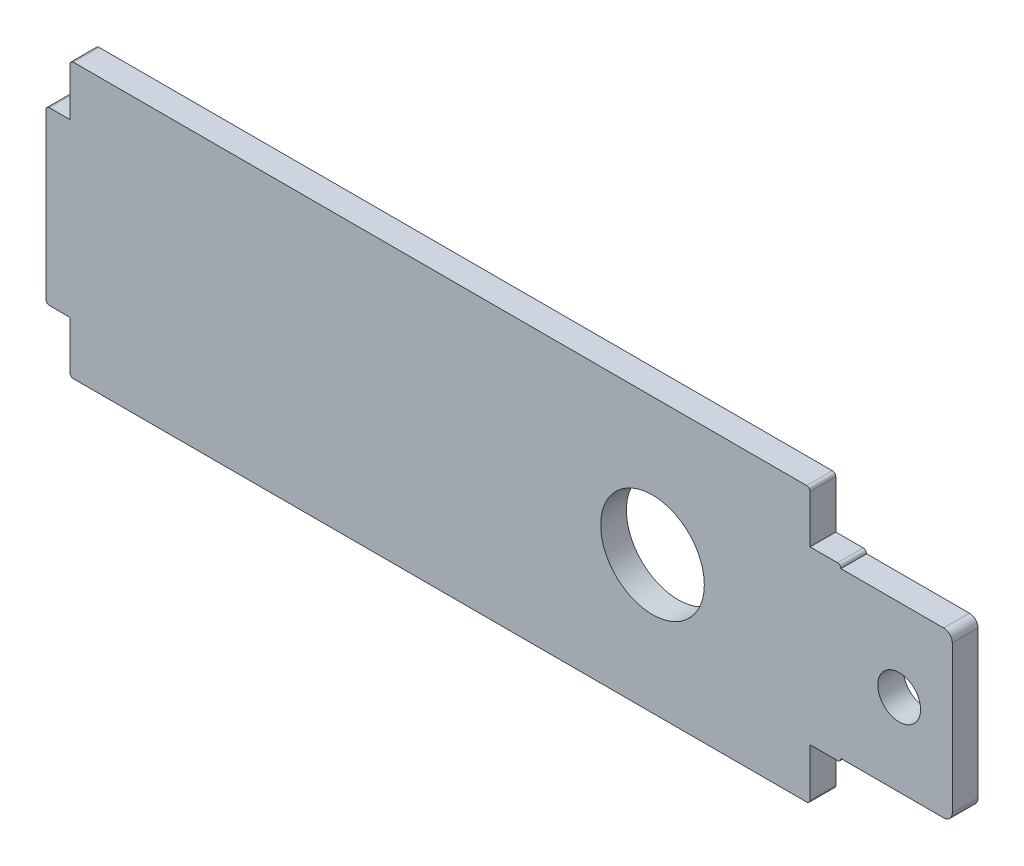
ISO-10303-21;
HEADER;
FILE_DESCRIPTION(('STEP AP214'),'2;1');
FILE_NAME('part.step','',(''),(''),'','','');
FILE_SCHEMA(('AUTOMOTIVE_DESIGN { 1 0 10303 214 1 1 1 1 }'));
ENDSEC;
DATA;
#1=APPLICATION_CONTEXT('core data for automotive mechanical design processes');
#2=APPLICATION_PROTOCOL_DEFINITION('international standard','automotive_design',2000,#1);
#3=PRODUCT_CONTEXT('',#1,'mechanical');
#4=PRODUCT('Part','Part','',(#3));
#5=PRODUCT_RELATED_PRODUCT_CATEGORY('part','',(#4));
#6=PRODUCT_DEFINITION_FORMATION('','',#4);
#7=PRODUCT_DEFINITION_CONTEXT('part definition',#1,'design');
#8=PRODUCT_DEFINITION('design','',#6,#7);
#9=PRODUCT_DEFINITION_SHAPE('','',#8);
#10=(LENGTH_UNIT() NAMED_UNIT(*) SI_UNIT(.MILLI.,.METRE.));
#11=(NAMED_UNIT(*) PLANE_ANGLE_UNIT() SI_UNIT($,.RADIAN.));
#12=(NAMED_UNIT(*) SI_UNIT($,.STERADIAN.) SOLID_ANGLE_UNIT());
#13=UNCERTAINTY_MEASURE_WITH_UNIT(LENGTH_MEASURE(1.E-05),#10,'distance_accuracy_value','');
#14=(GEOMETRIC_REPRESENTATION_CONTEXT(3) GLOBAL_UNCERTAINTY_ASSIGNED_CONTEXT((#13)) GLOBAL_UNIT_ASSIGNED_CONTEXT((#10,
#11,#12)) REPRESENTATION_CONTEXT('',''));
#15=CARTESIAN_POINT('',(0.,0.,0.));
#16=DIRECTION('',(0.,0.,1.));
#17=DIRECTION('',(1.,0.,0.));
#18=AXIS2_PLACEMENT_3D('',#15,#16,#17);
#19=CARTESIAN_POINT('',(44.4,2.2,-1.5));
#20=DIRECTION('',(0.,0.,1.));
#21=DIRECTION('',(1.,0.,0.));
#22=AXIS2_PLACEMENT_3D('',#19,#20,#21);
#23=CYLINDRICAL_SURFACE('',#22,0.200000000000003);
#24=CARTESIAN_POINT('',(44.4,2.2,0.));
#25=DIRECTION('',(0.,0.,1.));
#26=DIRECTION('',(-1.,0.,0.));
#27=AXIS2_PLACEMENT_3D('',#24,#25,#26);
#28=CIRCLE('',#27,0.200000000000003);
#29=CARTESIAN_POINT('',(44.4,2.,0.));
#30=VERTEX_POINT('',#29);
#31=CARTESIAN_POINT('',(44.6,2.2,0.));
#32=VERTEX_POINT('',#31);
#33=EDGE_CURVE('E204',#30,#32,#28,.T.);
#34=ORIENTED_EDGE('',*,*,#33,.F.);
#35=DIRECTION('',(0.,0.,1.));
#36=VECTOR('',#35,1.);
#37=CARTESIAN_POINT('',(44.4,2.,-1.5));
#38=LINE('',#37,#36);
#39=CARTESIAN_POINT('',(44.4,2.,-1.5));
#40=VERTEX_POINT('',#39);
#41=EDGE_CURVE('E11',#40,#30,#38,.T.);
#42=ORIENTED_EDGE('',*,*,#41,.F.);
#43=CARTESIAN_POINT('',(44.4,2.2,-1.5));
#44=DIRECTION('',(0.,0.,1.));
#45=DIRECTION('',(-1.,0.,0.));
#46=AXIS2_PLACEMENT_3D('',#43,#44,#45);
#47=CIRCLE('',#46,0.200000000000003);
#48=CARTESIAN_POINT('',(44.6,2.2,-1.5));
#49=VERTEX_POINT('',#48);
#50=EDGE_CURVE('E258',#40,#49,#47,.T.);
#51=ORIENTED_EDGE('',*,*,#50,.T.);
#52=DIRECTION('',(0.,0.,1.));
#53=VECTOR('',#52,1.);
#54=CARTESIAN_POINT('',(44.6,2.2,-1.5));
#55=LINE('',#54,#53);
#56=EDGE_CURVE('E42',#49,#32,#55,.T.);
#57=ORIENTED_EDGE('',*,*,#56,.T.);
#58=EDGE_LOOP('',(#34,#42,#51,#57));
#59=FACE_BOUND('',#58,.T.);
#60=ADVANCED_FACE('F39',(#59),#23,.T.);
#61=CARTESIAN_POINT('',(1.6,2.,-1.5));
#62=DIRECTION('',(0.,-1.,0.));
#63=DIRECTION('',(1.,0.,0.));
#64=AXIS2_PLACEMENT_3D('',#61,#62,#63);
#65=PLANE('',#64);
#66=DIRECTION('',(1.,0.,0.));
#67=VECTOR('',#66,1.);
#68=CARTESIAN_POINT('',(1.6,2.,0.));
#69=LINE('',#68,#67);
#70=CARTESIAN_POINT('',(1.6,2.,0.));
#71=VERTEX_POINT('',#70);
#72=EDGE_CURVE('E256',#71,#30,#69,.T.);
#73=ORIENTED_EDGE('',*,*,#72,.F.);
#74=DIRECTION('',(0.,0.,1.));
#75=VECTOR('',#74,1.);
#76=CARTESIAN_POINT('',(1.6,2.,-1.5));
#77=LINE('',#76,#75);
#78=CARTESIAN_POINT('',(1.6,2.,-1.5));
#79=VERTEX_POINT('',#78);
#80=EDGE_CURVE('E48',#79,#71,#77,.T.);
#81=ORIENTED_EDGE('',*,*,#80,.F.);
#82=DIRECTION('',(1.,0.,0.));
#83=VECTOR('',#82,1.);
#84=CARTESIAN_POINT('',(1.6,2.,-1.5));
#85=LINE('',#84,#83);
#86=EDGE_CURVE('E194',#79,#40,#85,.T.);
#87=ORIENTED_EDGE('',*,*,#86,.T.);
#88=ORIENTED_EDGE('',*,*,#41,.T.);
#89=EDGE_LOOP('',(#73,#81,#87,#88));
#90=FACE_BOUND('',#89,.T.);
#91=ADVANCED_FACE('F297',(#90),#65,.T.);
#92=CARTESIAN_POINT('',(1.6,2.2,-1.5));
#93=DIRECTION('',(0.,0.,1.));
#94=DIRECTION('',(1.,0.,0.));
#95=AXIS2_PLACEMENT_3D('',#92,#93,#94);
#96=CYLINDRICAL_SURFACE('',#95,0.2);
#97=CARTESIAN_POINT('',(1.6,2.2,0.));
#98=DIRECTION('',(0.,0.,1.));
#99=DIRECTION('',(1.,0.,0.));
#100=AXIS2_PLACEMENT_3D('',#97,#98,#99);
#101=CIRCLE('',#100,0.2);
#102=CARTESIAN_POINT('',(1.4,2.2,0.));
#103=VERTEX_POINT('',#102);
#104=EDGE_CURVE('E180',#103,#71,#101,.T.);
#105=ORIENTED_EDGE('',*,*,#104,.F.);
#106=DIRECTION('',(0.,0.,1.));
#107=VECTOR('',#106,1.);
#108=CARTESIAN_POINT('',(1.4,2.2,-1.5));
#109=LINE('',#108,#107);
#110=CARTESIAN_POINT('',(1.4,2.2,-1.5));
#111=VERTEX_POINT('',#110);
#112=EDGE_CURVE('E175',#111,#103,#109,.T.);
#113=ORIENTED_EDGE('',*,*,#112,.F.);
#114=CARTESIAN_POINT('',(1.6,2.2,-1.5));
#115=DIRECTION('',(0.,0.,1.));
#116=DIRECTION('',(1.,0.,0.));
#117=AXIS2_PLACEMENT_3D('',#114,#115,#116);
#118=CIRCLE('',#117,0.2);
#119=EDGE_CURVE('E178',#111,#79,#118,.T.);
#120=ORIENTED_EDGE('',*,*,#119,.T.);
#121=ORIENTED_EDGE('',*,*,#80,.T.);
#122=EDGE_LOOP('',(#105,#113,#120,#121));
#123=FACE_BOUND('',#122,.T.);
#124=ADVANCED_FACE('F177',(#123),#96,.T.);
#125=CARTESIAN_POINT('',(1.4,2.2,-1.5));
#126=DIRECTION('',(-1.,0.,0.));
#127=DIRECTION('',(0.,-1.,0.));
#128=AXIS2_PLACEMENT_3D('',#125,#126,#127);
#129=PLANE('',#128);
#130=DIRECTION('',(0.,-1.,0.));
#131=VECTOR('',#130,1.);
#132=CARTESIAN_POINT('',(1.4,2.2,0.));
#133=LINE('',#132,#131);
#134=CARTESIAN_POINT('',(1.4,5.,0.));
#135=VERTEX_POINT('',#134);
#136=EDGE_CURVE('E253',#135,#103,#133,.T.);
#137=ORIENTED_EDGE('',*,*,#136,.F.);
#138=DIRECTION('',(0.,0.,1.));
#139=VECTOR('',#138,1.);
#140=CARTESIAN_POINT('',(1.4,5.,-1.5));
#141=LINE('',#140,#139);
#142=CARTESIAN_POINT('',(1.4,5.,-1.5));
#143=VERTEX_POINT('',#142);
#144=EDGE_CURVE('E185',#143,#135,#141,.T.);
#145=ORIENTED_EDGE('',*,*,#144,.F.);
#146=DIRECTION('',(0.,-1.,0.));
#147=VECTOR('',#146,1.);
#148=CARTESIAN_POINT('',(1.4,2.2,-1.5));
#149=LINE('',#148,#147);
#150=EDGE_CURVE('E192',#143,#111,#149,.T.);
#151=ORIENTED_EDGE('',*,*,#150,.T.);
#152=ORIENTED_EDGE('',*,*,#112,.T.);
#153=EDGE_LOOP('',(#137,#145,#151,#152));
#154=FACE_BOUND('',#153,.T.);
#155=ADVANCED_FACE('F196',(#154),#129,.T.);
#156=CARTESIAN_POINT('',(1.4,5.,-1.5));
#157=DIRECTION('',(0.,-1.,0.));
#158=DIRECTION('',(0.,0.,-1.));
#159=AXIS2_PLACEMENT_3D('',#156,#157,#158);
#160=PLANE('',#159);
#161=DIRECTION('',(1.,0.,0.));
#162=VECTOR('',#161,1.);
#163=CARTESIAN_POINT('',(1.4,5.,0.));
#164=LINE('',#163,#162);
#165=CARTESIAN_POINT('',(0.200000000000002,5.,0.));
#166=VERTEX_POINT('',#165);
#167=EDGE_CURVE('E250',#166,#135,#164,.T.);
#168=ORIENTED_EDGE('',*,*,#167,.F.);
#169=DIRECTION('',(0.,0.,1.));
#170=VECTOR('',#169,1.);
#171=CARTESIAN_POINT('',(0.200000000000002,5.,-1.5));
#172=LINE('',#171,#170);
#173=CARTESIAN_POINT('',(0.200000000000002,5.,-1.5));
#174=VERTEX_POINT('',#173);
#175=EDGE_CURVE('E262',#174,#166,#172,.T.);
#176=ORIENTED_EDGE('',*,*,#175,.F.);
#177=DIRECTION('',(1.,0.,0.));
#178=VECTOR('',#177,1.);
#179=CARTESIAN_POINT('',(1.4,5.,-1.5));
#180=LINE('',#179,#178);
#181=EDGE_CURVE('E197',#174,#143,#180,.T.);
#182=ORIENTED_EDGE('',*,*,#181,.T.);
#183=ORIENTED_EDGE('',*,*,#144,.T.);
#184=EDGE_LOOP('',(#168,#176,#182,#183));
#185=FACE_BOUND('',#184,.T.);
#186=ADVANCED_FACE('F310',(#185),#160,.T.);
#187=CARTESIAN_POINT('',(0.2,5.2,-1.5));
#188=DIRECTION('',(0.,0.,1.));
#189=DIRECTION('',(1.,0.,0.));
#190=AXIS2_PLACEMENT_3D('',#187,#188,#189);
#191=CYLINDRICAL_SURFACE('',#190,0.2);
#192=CARTESIAN_POINT('',(0.2,5.2,0.));
#193=DIRECTION('',(0.,0.,1.));
#194=DIRECTION('',(-1.,0.,0.));
#195=AXIS2_PLACEMENT_3D('',#192,#193,#194);
#196=CIRCLE('',#195,0.2);
#197=CARTESIAN_POINT('',(0.,5.2,0.));
#198=VERTEX_POINT('',#197);
#199=EDGE_CURVE('E247',#198,#166,#196,.T.);
#200=ORIENTED_EDGE('',*,*,#199,.F.);
#201=DIRECTION('',(0.,0.,1.));
#202=VECTOR('',#201,1.);
#203=CARTESIAN_POINT('',(0.,5.2,-1.5));
#204=LINE('',#203,#202);
#205=CARTESIAN_POINT('',(0.,5.2,-1.5));
#206=VERTEX_POINT('',#205);
#207=EDGE_CURVE('E264',#206,#198,#204,.T.);
#208=ORIENTED_EDGE('',*,*,#207,.F.);
#209=CARTESIAN_POINT('',(0.2,5.2,-1.5));
#210=DIRECTION('',(0.,0.,1.));
#211=DIRECTION('',(-1.,0.,0.));
#212=AXIS2_PLACEMENT_3D('',#209,#210,#211);
#213=CIRCLE('',#212,0.2);
#214=EDGE_CURVE('E199',#206,#174,#213,.T.);
#215=ORIENTED_EDGE('',*,*,#214,.T.);
#216=ORIENTED_EDGE('',*,*,#175,.T.);
#217=EDGE_LOOP('',(#200,#208,#215,#216));
#218=FACE_BOUND('',#217,.T.);
#219=ADVANCED_FACE('F313',(#218),#191,.T.);
#220=CARTESIAN_POINT('',(0.,5.2,-1.5));
#221=DIRECTION('',(-1.,0.,0.));
#222=DIRECTION('',(0.,0.,1.));
#223=AXIS2_PLACEMENT_3D('',#220,#221,#222);
#224=PLANE('',#223);
#225=DIRECTION('',(0.,-1.,0.));
#226=VECTOR('',#225,1.);
#227=CARTESIAN_POINT('',(0.,5.2,0.));
#228=LINE('',#227,#226);
#229=CARTESIAN_POINT('',(0.,14.8,0.));
#230=VERTEX_POINT('',#229);
#231=EDGE_CURVE('E244',#230,#198,#228,.T.);
#232=ORIENTED_EDGE('',*,*,#231,.F.);
#233=DIRECTION('',(0.,0.,1.));
#234=VECTOR('',#233,1.);
#235=CARTESIAN_POINT('',(0.,14.8,-1.5));
#236=LINE('',#235,#234);
#237=CARTESIAN_POINT('',(0.,14.8,-1.5));
#238=VERTEX_POINT('',#237);
#239=EDGE_CURVE('E266',#238,#230,#236,.T.);
#240=ORIENTED_EDGE('',*,*,#239,.F.);
#241=DIRECTION('',(0.,-1.,0.));
#242=VECTOR('',#241,1.);
#243=CARTESIAN_POINT('',(0.,5.2,-1.5));
#244=LINE('',#243,#242);
#245=EDGE_CURVE('E496',#238,#206,#244,.T.);
#246=ORIENTED_EDGE('',*,*,#245,.T.);
#247=ORIENTED_EDGE('',*,*,#207,.T.);
#248=EDGE_LOOP('',(#232,#240,#246,#247));
#249=FACE_BOUND('',#248,.T.);
#250=ADVANCED_FACE('F317',(#249),#224,.T.);
#251=CARTESIAN_POINT('',(0.2,14.8,-1.5));
#252=DIRECTION('',(0.,0.,1.));
#253=DIRECTION('',(1.,0.,0.));
#254=AXIS2_PLACEMENT_3D('',#251,#252,#253);
#255=CYLINDRICAL_SURFACE('',#254,0.2);
#256=CARTESIAN_POINT('',(0.2,14.8,0.));
#257=DIRECTION('',(0.,0.,1.));
#258=DIRECTION('',(1.,0.,0.));
#259=AXIS2_PLACEMENT_3D('',#256,#257,#258);
#260=CIRCLE('',#259,0.2);
#261=CARTESIAN_POINT('',(0.200000000000001,15.,0.));
#262=VERTEX_POINT('',#261);
#263=EDGE_CURVE('E241',#262,#230,#260,.T.);
#264=ORIENTED_EDGE('',*,*,#263,.F.);
#265=DIRECTION('',(0.,0.,1.));
#266=VECTOR('',#265,1.);
#267=CARTESIAN_POINT('',(0.200000000000001,15.,-1.5));
#268=LINE('',#267,#266);
#269=CARTESIAN_POINT('',(0.200000000000001,15.,-1.5));
#270=VERTEX_POINT('',#269);
#271=EDGE_CURVE('E268',#270,#262,#268,.T.);
#272=ORIENTED_EDGE('',*,*,#271,.F.);
#273=CARTESIAN_POINT('',(0.2,14.8,-1.5));
#274=DIRECTION('',(0.,0.,1.));
#275=DIRECTION('',(1.,0.,0.));
#276=AXIS2_PLACEMENT_3D('',#273,#274,#275);
#277=CIRCLE('',#276,0.2);
#278=EDGE_CURVE('E493',#270,#238,#277,.T.);
#279=ORIENTED_EDGE('',*,*,#278,.T.);
#280=ORIENTED_EDGE('',*,*,#239,.T.);
#281=EDGE_LOOP('',(#264,#272,#279,#280));
#282=FACE_BOUND('',#281,.T.);
#283=ADVANCED_FACE('F321',(#282),#255,.T.);
#284=CARTESIAN_POINT('',(1.4,15.,-1.5));
#285=DIRECTION('',(0.,1.,0.));
#286=DIRECTION('',(0.,0.,1.));
#287=AXIS2_PLACEMENT_3D('',#284,#285,#286);
#288=PLANE('',#287);
#289=DIRECTION('',(-1.,0.,0.));
#290=VECTOR('',#289,1.);
#291=CARTESIAN_POINT('',(1.4,15.,0.));
#292=LINE('',#291,#290);
#293=CARTESIAN_POINT('',(1.4,15.,0.));
#294=VERTEX_POINT('',#293);
#295=EDGE_CURVE('E238',#294,#262,#292,.T.);
#296=ORIENTED_EDGE('',*,*,#295,.F.);
#297=DIRECTION('',(0.,0.,1.));
#298=VECTOR('',#297,1.);
#299=CARTESIAN_POINT('',(1.4,15.,-1.5));
#300=LINE('',#299,#298);
#301=CARTESIAN_POINT('',(1.4,15.,-1.5));
#302=VERTEX_POINT('',#301);
#303=EDGE_CURVE('E270',#302,#294,#300,.T.);
#304=ORIENTED_EDGE('',*,*,#303,.F.);
#305=DIRECTION('',(-1.,0.,0.));
#306=VECTOR('',#305,1.);
#307=CARTESIAN_POINT('',(1.4,15.,-1.5));
#308=LINE('',#307,#306);
#309=EDGE_CURVE('E490',#302,#270,#308,.T.);
#310=ORIENTED_EDGE('',*,*,#309,.T.);
#311=ORIENTED_EDGE('',*,*,#271,.T.);
#312=EDGE_LOOP('',(#296,#304,#310,#311));
#313=FACE_BOUND('',#312,.T.);
#314=ADVANCED_FACE('F325',(#313),#288,.T.);
#315=CARTESIAN_POINT('',(1.4,17.8,-1.5));
#316=DIRECTION('',(-1.,0.,0.));
#317=DIRECTION('',(0.,-1.,0.));
#318=AXIS2_PLACEMENT_3D('',#315,#316,#317);
#319=PLANE('',#318);
#320=DIRECTION('',(0.,-1.,0.));
#321=VECTOR('',#320,1.);
#322=CARTESIAN_POINT('',(1.4,17.8,0.));
#323=LINE('',#322,#321);
#324=CARTESIAN_POINT('',(1.4,17.8,0.));
#325=VERTEX_POINT('',#324);
#326=EDGE_CURVE('E235',#325,#294,#323,.T.);
#327=ORIENTED_EDGE('',*,*,#326,.F.);
#328=DIRECTION('',(0.,0.,1.));
#329=VECTOR('',#328,1.);
#330=CARTESIAN_POINT('',(1.4,17.8,-1.5));
#331=LINE('',#330,#329);
#332=CARTESIAN_POINT('',(1.4,17.8,-1.5));
#333=VERTEX_POINT('',#332);
#334=EDGE_CURVE('E272',#333,#325,#331,.T.);
#335=ORIENTED_EDGE('',*,*,#334,.F.);
#336=DIRECTION('',(0.,-1.,0.));
#337=VECTOR('',#336,1.);
#338=CARTESIAN_POINT('',(1.4,17.8,-1.5));
#339=LINE('',#338,#337);
#340=EDGE_CURVE('E487',#333,#302,#339,.T.);
#341=ORIENTED_EDGE('',*,*,#340,.T.);
#342=ORIENTED_EDGE('',*,*,#303,.T.);
#343=EDGE_LOOP('',(#327,#335,#341,#342));
#344=FACE_BOUND('',#343,.T.);
#345=ADVANCED_FACE('F329',(#344),#319,.T.);
#346=CARTESIAN_POINT('',(1.6,17.8,-1.5));
#347=DIRECTION('',(0.,0.,1.));
#348=DIRECTION('',(1.,0.,0.));
#349=AXIS2_PLACEMENT_3D('',#346,#347,#348);
#350=CYLINDRICAL_SURFACE('',#349,0.200000000000001);
#351=CARTESIAN_POINT('',(1.6,17.8,0.));
#352=DIRECTION('',(0.,0.,1.));
#353=DIRECTION('',(-1.,0.,0.));
#354=AXIS2_PLACEMENT_3D('',#351,#352,#353);
#355=CIRCLE('',#354,0.200000000000001);
#356=CARTESIAN_POINT('',(1.6,18.,0.));
#357=VERTEX_POINT('',#356);
#358=EDGE_CURVE('E232',#357,#325,#355,.T.);
#359=ORIENTED_EDGE('',*,*,#358,.F.);
#360=DIRECTION('',(0.,0.,1.));
#361=VECTOR('',#360,1.);
#362=CARTESIAN_POINT('',(1.6,18.,-1.5));
#363=LINE('',#362,#361);
#364=CARTESIAN_POINT('',(1.6,18.,-1.5));
#365=VERTEX_POINT('',#364);
#366=EDGE_CURVE('E274',#365,#357,#363,.T.);
#367=ORIENTED_EDGE('',*,*,#366,.F.);
#368=CARTESIAN_POINT('',(1.6,17.8,-1.5));
#369=DIRECTION('',(0.,0.,1.));
#370=DIRECTION('',(-1.,0.,0.));
#371=AXIS2_PLACEMENT_3D('',#368,#369,#370);
#372=CIRCLE('',#371,0.200000000000001);
#373=EDGE_CURVE('E484',#365,#333,#372,.T.);
#374=ORIENTED_EDGE('',*,*,#373,.T.);
#375=ORIENTED_EDGE('',*,*,#334,.T.);
#376=EDGE_LOOP('',(#359,#367,#374,#375));
#377=FACE_BOUND('',#376,.T.);
#378=ADVANCED_FACE('F333',(#377),#350,.T.);
#379=CARTESIAN_POINT('',(1.6,18.,-1.5));
#380=DIRECTION('',(0.,1.,0.));
#381=DIRECTION('',(0.,0.,1.));
#382=AXIS2_PLACEMENT_3D('',#379,#380,#381);
#383=PLANE('',#382);
#384=DIRECTION('',(-1.,0.,0.));
#385=VECTOR('',#384,1.);
#386=CARTESIAN_POINT('',(1.6,18.,0.));
#387=LINE('',#386,#385);
#388=CARTESIAN_POINT('',(44.4,18.,0.));
#389=VERTEX_POINT('',#388);
#390=EDGE_CURVE('E229',#389,#357,#387,.T.);
#391=ORIENTED_EDGE('',*,*,#390,.F.);
#392=DIRECTION('',(0.,0.,1.));
#393=VECTOR('',#392,1.);
#394=CARTESIAN_POINT('',(44.4,18.,-1.5));
#395=LINE('',#394,#393);
#396=CARTESIAN_POINT('',(44.4,18.,-1.5));
#397=VERTEX_POINT('',#396);
#398=EDGE_CURVE('E276',#397,#389,#395,.T.);
#399=ORIENTED_EDGE('',*,*,#398,.F.);
#400=DIRECTION('',(-1.,0.,0.));
#401=VECTOR('',#400,1.);
#402=CARTESIAN_POINT('',(1.6,18.,-1.5));
#403=LINE('',#402,#401);
#404=EDGE_CURVE('E481',#397,#365,#403,.T.);
#405=ORIENTED_EDGE('',*,*,#404,.T.);
#406=ORIENTED_EDGE('',*,*,#366,.T.);
#407=EDGE_LOOP('',(#391,#399,#405,#406));
#408=FACE_BOUND('',#407,.T.);
#409=ADVANCED_FACE('F337',(#408),#383,.T.);
#410=CARTESIAN_POINT('',(44.4,17.8,-1.5));
#411=DIRECTION('',(0.,0.,1.));
#412=DIRECTION('',(1.,0.,0.));
#413=AXIS2_PLACEMENT_3D('',#410,#411,#412);
#414=CYLINDRICAL_SURFACE('',#413,0.200000000000004);
#415=CARTESIAN_POINT('',(44.4,17.8,0.));
#416=DIRECTION('',(0.,0.,1.));
#417=DIRECTION('',(1.,0.,0.));
#418=AXIS2_PLACEMENT_3D('',#415,#416,#417);
#419=CIRCLE('',#418,0.200000000000004);
#420=CARTESIAN_POINT('',(44.6,17.8,0.));
#421=VERTEX_POINT('',#420);
#422=EDGE_CURVE('E226',#421,#389,#419,.T.);
#423=ORIENTED_EDGE('',*,*,#422,.F.);
#424=DIRECTION('',(0.,0.,1.));
#425=VECTOR('',#424,1.);
#426=CARTESIAN_POINT('',(44.6,17.8,-1.5));
#427=LINE('',#426,#425);
#428=CARTESIAN_POINT('',(44.6,17.8,-1.5));
#429=VERTEX_POINT('',#428);
#430=EDGE_CURVE('E278',#429,#421,#427,.T.);
#431=ORIENTED_EDGE('',*,*,#430,.F.);
#432=CARTESIAN_POINT('',(44.4,17.8,-1.5));
#433=DIRECTION('',(0.,0.,1.));
#434=DIRECTION('',(1.,0.,0.));
#435=AXIS2_PLACEMENT_3D('',#432,#433,#434);
#436=CIRCLE('',#435,0.200000000000004);
#437=EDGE_CURVE('E478',#429,#397,#436,.T.);
#438=ORIENTED_EDGE('',*,*,#437,.T.);
#439=ORIENTED_EDGE('',*,*,#398,.T.);
#440=EDGE_LOOP('',(#423,#431,#438,#439));
#441=FACE_BOUND('',#440,.T.);
#442=ADVANCED_FACE('F341',(#441),#414,.T.);
#443=CARTESIAN_POINT('',(44.6,17.8,-1.5));
#444=DIRECTION('',(1.,0.,0.));
#445=DIRECTION('',(0.,0.,-1.));
#446=AXIS2_PLACEMENT_3D('',#443,#444,#445);
#447=PLANE('',#446);
#448=DIRECTION('',(0.,1.,0.));
#449=VECTOR('',#448,1.);
#450=CARTESIAN_POINT('',(44.6,17.8,0.));
#451=LINE('',#450,#449);
#452=CARTESIAN_POINT('',(44.6,15.,0.));
#453=VERTEX_POINT('',#452);
#454=EDGE_CURVE('E223',#453,#421,#451,.T.);
#455=ORIENTED_EDGE('',*,*,#454,.F.);
#456=DIRECTION('',(0.,0.,1.));
#457=VECTOR('',#456,1.);
#458=CARTESIAN_POINT('',(44.6,15.,-1.5));
#459=LINE('',#458,#457);
#460=CARTESIAN_POINT('',(44.6,15.,-1.5));
#461=VERTEX_POINT('',#460);
#462=EDGE_CURVE('E280',#461,#453,#459,.T.);
#463=ORIENTED_EDGE('',*,*,#462,.F.);
#464=DIRECTION('',(0.,1.,0.));
#465=VECTOR('',#464,1.);
#466=CARTESIAN_POINT('',(44.6,17.8,-1.5));
#467=LINE('',#466,#465);
#468=EDGE_CURVE('E475',#461,#429,#467,.T.);
#469=ORIENTED_EDGE('',*,*,#468,.T.);
#470=ORIENTED_EDGE('',*,*,#430,.T.);
#471=EDGE_LOOP('',(#455,#463,#469,#470));
#472=FACE_BOUND('',#471,.T.);
#473=ADVANCED_FACE('F345',(#472),#447,.T.);
#474=CARTESIAN_POINT('',(44.6,15.,-1.5));
#475=DIRECTION('',(0.,1.,0.));
#476=DIRECTION('',(0.,0.,1.));
#477=AXIS2_PLACEMENT_3D('',#474,#475,#476);
#478=PLANE('',#477);
#479=DIRECTION('',(-1.,0.,0.));
#480=VECTOR('',#479,1.);
#481=CARTESIAN_POINT('',(44.6,15.,0.));
#482=LINE('',#481,#480);
#483=CARTESIAN_POINT('',(46.2,15.,0.));
#484=VERTEX_POINT('',#483);
#485=EDGE_CURVE('E220',#484,#453,#482,.T.);
#486=ORIENTED_EDGE('',*,*,#485,.F.);
#487=DIRECTION('',(0.,0.,1.));
#488=VECTOR('',#487,1.);
#489=CARTESIAN_POINT('',(46.2,15.,-1.5));
#490=LINE('',#489,#488);
#491=CARTESIAN_POINT('',(46.2,15.,-1.5));
#492=VERTEX_POINT('',#491);
#493=EDGE_CURVE('E282',#492,#484,#490,.T.);
#494=ORIENTED_EDGE('',*,*,#493,.F.);
#495=DIRECTION('',(-1.,0.,0.));
#496=VECTOR('',#495,1.);
#497=CARTESIAN_POINT('',(44.6,15.,-1.5));
#498=LINE('',#497,#496);
#499=EDGE_CURVE('E472',#492,#461,#498,.T.);
#500=ORIENTED_EDGE('',*,*,#499,.T.);
#501=ORIENTED_EDGE('',*,*,#462,.T.);
#502=EDGE_LOOP('',(#486,#494,#500,#501));
#503=FACE_BOUND('',#502,.T.);
#504=ADVANCED_FACE('F349',(#503),#478,.T.);
#505=CARTESIAN_POINT('',(46.2,14.8,-1.5));
#506=DIRECTION('',(0.,0.,1.));
#507=DIRECTION('',(1.,0.,0.));
#508=AXIS2_PLACEMENT_3D('',#505,#506,#507);
#509=CYLINDRICAL_SURFACE('',#508,0.199999999999999);
#510=CARTESIAN_POINT('',(46.2,14.8,0.));
#511=DIRECTION('',(0.,0.,1.));
#512=DIRECTION('',(-1.,0.,0.));
#513=AXIS2_PLACEMENT_3D('',#510,#511,#512);
#514=CIRCLE('',#513,0.199999999999999);
#515=CARTESIAN_POINT('',(46.4,14.8,0.));
#516=VERTEX_POINT('',#515);
#517=EDGE_CURVE('E217',#516,#484,#514,.T.);
#518=ORIENTED_EDGE('',*,*,#517,.F.);
#519=DIRECTION('',(0.,0.,1.));
#520=VECTOR('',#519,1.);
#521=CARTESIAN_POINT('',(46.4,14.8,-1.5));
#522=LINE('',#521,#520);
#523=CARTESIAN_POINT('',(46.4,14.8,-1.5));
#524=VERTEX_POINT('',#523);
#525=EDGE_CURVE('E284',#524,#516,#522,.T.);
#526=ORIENTED_EDGE('',*,*,#525,.F.);
#527=CARTESIAN_POINT('',(46.2,14.8,-1.5));
#528=DIRECTION('',(0.,0.,1.));
#529=DIRECTION('',(-1.,0.,0.));
#530=AXIS2_PLACEMENT_3D('',#527,#528,#529);
#531=CIRCLE('',#530,0.199999999999999);
#532=EDGE_CURVE('E469',#524,#492,#531,.T.);
#533=ORIENTED_EDGE('',*,*,#532,.T.);
#534=ORIENTED_EDGE('',*,*,#493,.T.);
#535=EDGE_LOOP('',(#518,#526,#533,#534));
#536=FACE_BOUND('',#535,.T.);
#537=ADVANCED_FACE('F353',(#536),#509,.T.);
#538=CARTESIAN_POINT('',(46.2,5.2,-1.5));
#539=DIRECTION('',(0.,0.,1.));
#540=DIRECTION('',(1.,0.,0.));
#541=AXIS2_PLACEMENT_3D('',#538,#539,#540);
#542=CYLINDRICAL_SURFACE('',#541,0.199999999999999);
#543=CARTESIAN_POINT('',(46.2,5.2,0.));
#544=DIRECTION('',(0.,0.,1.));
#545=DIRECTION('',(1.,0.,0.));
#546=AXIS2_PLACEMENT_3D('',#543,#544,#545);
#547=CIRCLE('',#546,0.199999999999999);
#548=CARTESIAN_POINT('',(46.2,5.,0.));
#549=VERTEX_POINT('',#548);
#550=CARTESIAN_POINT('',(46.4,5.2,0.));
#551=VERTEX_POINT('',#550);
#552=EDGE_CURVE('E214',#549,#551,#547,.T.);
#553=ORIENTED_EDGE('',*,*,#552,.F.);
#554=DIRECTION('',(0.,0.,1.));
#555=VECTOR('',#554,1.);
#556=CARTESIAN_POINT('',(46.2,5.,-1.5));
#557=LINE('',#556,#555);
#558=CARTESIAN_POINT('',(46.2,5.,-1.5));
#559=VERTEX_POINT('',#558);
#560=EDGE_CURVE('E290',#559,#549,#557,.T.);
#561=ORIENTED_EDGE('',*,*,#560,.F.);
#562=CARTESIAN_POINT('',(46.2,5.2,-1.5));
#563=DIRECTION('',(0.,0.,1.));
#564=DIRECTION('',(1.,0.,0.));
#565=AXIS2_PLACEMENT_3D('',#562,#563,#564);
#566=CIRCLE('',#565,0.199999999999999);
#567=CARTESIAN_POINT('',(46.4,5.2,-1.5));
#568=VERTEX_POINT('',#567);
#569=EDGE_CURVE('E466',#559,#568,#566,.T.);
#570=ORIENTED_EDGE('',*,*,#569,.T.);
#571=DIRECTION('',(0.,0.,1.));
#572=VECTOR('',#571,1.);
#573=CARTESIAN_POINT('',(46.4,5.2,-1.5));
#574=LINE('',#573,#572);
#575=EDGE_CURVE('E287',#568,#551,#574,.T.);
#576=ORIENTED_EDGE('',*,*,#575,.T.);
#577=EDGE_LOOP('',(#553,#561,#570,#576));
#578=FACE_BOUND('',#577,.T.);
#579=ADVANCED_FACE('F357',(#578),#542,.T.);
#580=CARTESIAN_POINT('',(44.6,5.,-1.5));
#581=DIRECTION('',(0.,-1.,0.));
#582=DIRECTION('',(0.,0.,-1.));
#583=AXIS2_PLACEMENT_3D('',#580,#581,#582);
#584=PLANE('',#583);
#585=DIRECTION('',(1.,0.,0.));
#586=VECTOR('',#585,1.);
#587=CARTESIAN_POINT('',(44.6,5.,0.));
#588=LINE('',#587,#586);
#589=CARTESIAN_POINT('',(44.6,5.,0.));
#590=VERTEX_POINT('',#589);
#591=EDGE_CURVE('E211',#590,#549,#588,.T.);
#592=ORIENTED_EDGE('',*,*,#591,.F.);
#593=DIRECTION('',(0.,0.,1.));
#594=VECTOR('',#593,1.);
#595=CARTESIAN_POINT('',(44.6,5.,-1.5));
#596=LINE('',#595,#594);
#597=CARTESIAN_POINT('',(44.6,5.,-1.5));
#598=VERTEX_POINT('',#597);
#599=EDGE_CURVE('E291',#598,#590,#596,.T.);
#600=ORIENTED_EDGE('',*,*,#599,.F.);
#601=DIRECTION('',(1.,0.,0.));
#602=VECTOR('',#601,1.);
#603=CARTESIAN_POINT('',(44.6,5.,-1.5));
#604=LINE('',#603,#602);
#605=EDGE_CURVE('E463',#598,#559,#604,.T.);
#606=ORIENTED_EDGE('',*,*,#605,.T.);
#607=ORIENTED_EDGE('',*,*,#560,.T.);
#608=EDGE_LOOP('',(#592,#600,#606,#607));
#609=FACE_BOUND('',#608,.T.);
#610=ADVANCED_FACE('F361',(#609),#584,.T.);
#611=CARTESIAN_POINT('',(44.6,2.2,-1.5));
#612=DIRECTION('',(1.,0.,0.));
#613=DIRECTION('',(0.,0.,-1.));
#614=AXIS2_PLACEMENT_3D('',#611,#612,#613);
#615=PLANE('',#614);
#616=DIRECTION('',(0.,1.,0.));
#617=VECTOR('',#616,1.);
#618=CARTESIAN_POINT('',(44.6,2.2,0.));
#619=LINE('',#618,#617);
#620=EDGE_CURVE('E207',#32,#590,#619,.T.);
#621=ORIENTED_EDGE('',*,*,#620,.F.);
#622=ORIENTED_EDGE('',*,*,#56,.F.);
#623=DIRECTION('',(0.,1.,0.));
#624=VECTOR('',#623,1.);
#625=CARTESIAN_POINT('',(44.6,2.2,-1.5));
#626=LINE('',#625,#624);
#627=EDGE_CURVE('E461',#49,#598,#626,.T.);
#628=ORIENTED_EDGE('',*,*,#627,.T.);
#629=ORIENTED_EDGE('',*,*,#599,.T.);
#630=EDGE_LOOP('',(#621,#622,#628,#629));
#631=FACE_BOUND('',#630,.T.);
#632=ADVANCED_FACE('F293',(#631),#615,.T.);
#633=CARTESIAN_POINT('',(44.4,2.2,-1.5));
#634=DIRECTION('',(0.,0.,-1.));
#635=DIRECTION('',(-1.,0.,0.));
#636=AXIS2_PLACEMENT_3D('',#633,#634,#635);
#637=PLANE('',#636);
#638=CARTESIAN_POINT('',(35.4,10.,-1.5));
#639=DIRECTION('',(0.,0.,1.));
#640=DIRECTION('',(1.,0.,0.));
#641=AXIS2_PLACEMENT_3D('',#638,#639,#640);
#642=CIRCLE('',#641,3.025);
#643=CARTESIAN_POINT('',(38.425,10.,-1.5));
#644=VERTEX_POINT('',#643);
#645=EDGE_CURVE('E208',#644,#644,#642,.T.);
#646=ORIENTED_EDGE('',*,*,#645,.T.);
#647=EDGE_LOOP('',(#646));
#648=FACE_BOUND('',#647,.T.);
#649=ORIENTED_EDGE('',*,*,#50,.F.);
#650=ORIENTED_EDGE('',*,*,#86,.F.);
#651=ORIENTED_EDGE('',*,*,#119,.F.);
#652=ORIENTED_EDGE('',*,*,#150,.F.);
#653=ORIENTED_EDGE('',*,*,#181,.F.);
#654=ORIENTED_EDGE('',*,*,#214,.F.);
#655=ORIENTED_EDGE('',*,*,#245,.F.);
#656=ORIENTED_EDGE('',*,*,#278,.F.);
#657=ORIENTED_EDGE('',*,*,#309,.F.);
#658=ORIENTED_EDGE('',*,*,#340,.F.);
#659=ORIENTED_EDGE('',*,*,#373,.F.);
#660=ORIENTED_EDGE('',*,*,#404,.F.);
#661=ORIENTED_EDGE('',*,*,#437,.F.);
#662=ORIENTED_EDGE('',*,*,#468,.F.);
#663=ORIENTED_EDGE('',*,*,#499,.F.);
#664=ORIENTED_EDGE('',*,*,#532,.F.);
#665=DIRECTION('',(-1.,0.,0.));
#666=VECTOR('',#665,1.);
#667=CARTESIAN_POINT('',(46.4,14.8,-1.5));
#668=LINE('',#667,#666);
#669=CARTESIAN_POINT('',(52.4,14.8,-1.5));
#670=VERTEX_POINT('',#669);
#671=EDGE_CURVE('E429',#670,#524,#668,.T.);
#672=ORIENTED_EDGE('',*,*,#671,.F.);
#673=CARTESIAN_POINT('',(52.4,14.3,-1.5));
#674=DIRECTION('',(0.,0.,1.));
#675=DIRECTION('',(-1.,0.,0.));
#676=AXIS2_PLACEMENT_3D('',#673,#674,#675);
#677=CIRCLE('',#676,0.5);
#678=CARTESIAN_POINT('',(52.9,14.3,-1.5));
#679=VERTEX_POINT('',#678);
#680=EDGE_CURVE('E426',#679,#670,#677,.T.);
#681=ORIENTED_EDGE('',*,*,#680,.F.);
#682=DIRECTION('',(0.,1.,0.));
#683=VECTOR('',#682,1.);
#684=CARTESIAN_POINT('',(52.9,14.3,-1.5));
#685=LINE('',#684,#683);
#686=CARTESIAN_POINT('',(52.9,5.7,-1.5));
#687=VERTEX_POINT('',#686);
#688=EDGE_CURVE('E423',#687,#679,#685,.T.);
#689=ORIENTED_EDGE('',*,*,#688,.F.);
#690=CARTESIAN_POINT('',(52.4,5.7,-1.5));
#691=DIRECTION('',(0.,0.,1.));
#692=DIRECTION('',(-1.,0.,0.));
#693=AXIS2_PLACEMENT_3D('',#690,#691,#692);
#694=CIRCLE('',#693,0.5);
#695=CARTESIAN_POINT('',(52.4,5.2,-1.5));
#696=VERTEX_POINT('',#695);
#697=EDGE_CURVE('E419',#696,#687,#694,.T.);
#698=ORIENTED_EDGE('',*,*,#697,.F.);
#699=DIRECTION('',(1.,0.,0.));
#700=VECTOR('',#699,1.);
#701=CARTESIAN_POINT('',(52.4,5.2,-1.5));
#702=LINE('',#701,#700);
#703=EDGE_CURVE('E416',#568,#696,#702,.T.);
#704=ORIENTED_EDGE('',*,*,#703,.F.);
#705=ORIENTED_EDGE('',*,*,#569,.F.);
#706=ORIENTED_EDGE('',*,*,#605,.F.);
#707=ORIENTED_EDGE('',*,*,#627,.F.);
#708=EDGE_LOOP('',(#649,#650,#651,#652,#653,#654,#655,#656,#657,#658,#659,#660,#661,#662,#663,
#664,#672,#681,#689,#698,#704,#705,#706,#707));
#709=FACE_BOUND('',#708,.T.);
#710=CARTESIAN_POINT('',(49.8,10.,-1.5));
#711=DIRECTION('',(0.,0.,1.));
#712=DIRECTION('',(1.,0.,0.));
#713=AXIS2_PLACEMENT_3D('',#710,#711,#712);
#714=CIRCLE('',#713,1.25);
#715=CARTESIAN_POINT('',(51.05,10.,-1.5));
#716=VERTEX_POINT('',#715);
#717=EDGE_CURVE('E408',#716,#716,#714,.T.);
#718=ORIENTED_EDGE('',*,*,#717,.T.);
#719=EDGE_LOOP('',(#718));
#720=FACE_BOUND('',#719,.T.);
#721=ADVANCED_FACE('F189',(#648,#709,#720),#637,.T.);
#722=CARTESIAN_POINT('',(44.4,2.2,0.));
#723=DIRECTION('',(0.,0.,-1.));
#724=DIRECTION('',(-1.,0.,0.));
#725=AXIS2_PLACEMENT_3D('',#722,#723,#724);
#726=PLANE('',#725);
#727=CARTESIAN_POINT('',(35.4,10.,0.));
#728=DIRECTION('',(0.,0.,1.));
#729=DIRECTION('',(1.,0.,0.));
#730=AXIS2_PLACEMENT_3D('',#727,#728,#729);
#731=CIRCLE('',#730,3.025);
#732=CARTESIAN_POINT('',(38.425,10.,0.));
#733=VERTEX_POINT('',#732);
#734=EDGE_CURVE('E448',#733,#733,#731,.T.);
#735=ORIENTED_EDGE('',*,*,#734,.F.);
#736=EDGE_LOOP('',(#735));
#737=FACE_BOUND('',#736,.T.);
#738=ORIENTED_EDGE('',*,*,#33,.T.);
#739=ORIENTED_EDGE('',*,*,#620,.T.);
#740=ORIENTED_EDGE('',*,*,#591,.T.);
#741=ORIENTED_EDGE('',*,*,#552,.T.);
#742=DIRECTION('',(1.,0.,0.));
#743=VECTOR('',#742,1.);
#744=CARTESIAN_POINT('',(52.4,5.2,0.));
#745=LINE('',#744,#743);
#746=CARTESIAN_POINT('',(52.4,5.2,0.));
#747=VERTEX_POINT('',#746);
#748=EDGE_CURVE('E413',#551,#747,#745,.T.);
#749=ORIENTED_EDGE('',*,*,#748,.T.);
#750=CARTESIAN_POINT('',(52.4,5.7,0.));
#751=DIRECTION('',(0.,0.,1.));
#752=DIRECTION('',(-1.,0.,0.));
#753=AXIS2_PLACEMENT_3D('',#750,#751,#752);
#754=CIRCLE('',#753,0.5);
#755=CARTESIAN_POINT('',(52.9,5.7,0.));
#756=VERTEX_POINT('',#755);
#757=EDGE_CURVE('E435',#747,#756,#754,.T.);
#758=ORIENTED_EDGE('',*,*,#757,.T.);
#759=DIRECTION('',(0.,1.,0.));
#760=VECTOR('',#759,1.);
#761=CARTESIAN_POINT('',(52.9,14.3,0.));
#762=LINE('',#761,#760);
#763=CARTESIAN_POINT('',(52.9,14.3,0.));
#764=VERTEX_POINT('',#763);
#765=EDGE_CURVE('E438',#756,#764,#762,.T.);
#766=ORIENTED_EDGE('',*,*,#765,.T.);
#767=CARTESIAN_POINT('',(52.4,14.3,0.));
#768=DIRECTION('',(0.,0.,1.));
#769=DIRECTION('',(-1.,0.,0.));
#770=AXIS2_PLACEMENT_3D('',#767,#768,#769);
#771=CIRCLE('',#770,0.5);
#772=CARTESIAN_POINT('',(52.4,14.8,0.));
#773=VERTEX_POINT('',#772);
#774=EDGE_CURVE('E441',#764,#773,#771,.T.);
#775=ORIENTED_EDGE('',*,*,#774,.T.);
#776=DIRECTION('',(-1.,0.,0.));
#777=VECTOR('',#776,1.);
#778=CARTESIAN_POINT('',(46.4,14.8,0.));
#779=LINE('',#778,#777);
#780=EDGE_CURVE('E420',#773,#516,#779,.T.);
#781=ORIENTED_EDGE('',*,*,#780,.T.);
#782=ORIENTED_EDGE('',*,*,#517,.T.);
#783=ORIENTED_EDGE('',*,*,#485,.T.);
#784=ORIENTED_EDGE('',*,*,#454,.T.);
#785=ORIENTED_EDGE('',*,*,#422,.T.);
#786=ORIENTED_EDGE('',*,*,#390,.T.);
#787=ORIENTED_EDGE('',*,*,#358,.T.);
#788=ORIENTED_EDGE('',*,*,#326,.T.);
#789=ORIENTED_EDGE('',*,*,#295,.T.);
#790=ORIENTED_EDGE('',*,*,#263,.T.);
#791=ORIENTED_EDGE('',*,*,#231,.T.);
#792=ORIENTED_EDGE('',*,*,#199,.T.);
#793=ORIENTED_EDGE('',*,*,#167,.T.);
#794=ORIENTED_EDGE('',*,*,#136,.T.);
#795=ORIENTED_EDGE('',*,*,#104,.T.);
#796=ORIENTED_EDGE('',*,*,#72,.T.);
#797=EDGE_LOOP('',(#738,#739,#740,#741,#749,#758,#766,#775,#781,#782,#783,#784,#785,#786,#787,
#788,#789,#790,#791,#792,#793,#794,#795,#796));
#798=FACE_BOUND('',#797,.T.);
#799=CARTESIAN_POINT('',(49.8,10.,0.));
#800=DIRECTION('',(0.,0.,1.));
#801=DIRECTION('',(1.,0.,0.));
#802=AXIS2_PLACEMENT_3D('',#799,#800,#801);
#803=CIRCLE('',#802,1.25);
#804=CARTESIAN_POINT('',(51.05,10.,0.));
#805=VERTEX_POINT('',#804);
#806=EDGE_CURVE('E411',#805,#805,#803,.T.);
#807=ORIENTED_EDGE('',*,*,#806,.F.);
#808=EDGE_LOOP('',(#807));
#809=FACE_BOUND('',#808,.T.);
#810=ADVANCED_FACE('F295',(#737,#798,#809),#726,.F.);
#811=CARTESIAN_POINT('',(35.4,10.,-1.5));
#812=DIRECTION('',(0.,0.,1.));
#813=DIRECTION('',(1.,0.,0.));
#814=AXIS2_PLACEMENT_3D('',#811,#812,#813);
#815=CYLINDRICAL_SURFACE('',#814,3.025);
#816=ORIENTED_EDGE('',*,*,#645,.F.);
#817=EDGE_LOOP('',(#816));
#818=FACE_BOUND('',#817,.T.);
#819=ORIENTED_EDGE('',*,*,#734,.T.);
#820=EDGE_LOOP('',(#819));
#821=FACE_BOUND('',#820,.T.);
#822=ADVANCED_FACE('F373',(#818,#821),#815,.F.);
#823=CARTESIAN_POINT('',(46.4,14.8,-1.5));
#824=DIRECTION('',(0.,1.,0.));
#825=DIRECTION('',(-1.,0.,0.));
#826=AXIS2_PLACEMENT_3D('',#823,#824,#825);
#827=PLANE('',#826);
#828=ORIENTED_EDGE('',*,*,#780,.F.);
#829=DIRECTION('',(0.,0.,1.));
#830=VECTOR('',#829,1.);
#831=CARTESIAN_POINT('',(52.4,14.8,-1.5));
#832=LINE('',#831,#830);
#833=EDGE_CURVE('E445',#670,#773,#832,.T.);
#834=ORIENTED_EDGE('',*,*,#833,.F.);
#835=ORIENTED_EDGE('',*,*,#671,.T.);
#836=ORIENTED_EDGE('',*,*,#525,.T.);
#837=EDGE_LOOP('',(#828,#834,#835,#836));
#838=FACE_BOUND('',#837,.T.);
#839=ADVANCED_FACE('F379',(#838),#827,.T.);
#840=CARTESIAN_POINT('',(52.4,14.3,-1.5));
#841=DIRECTION('',(0.,0.,1.));
#842=DIRECTION('',(1.,0.,0.));
#843=AXIS2_PLACEMENT_3D('',#840,#841,#842);
#844=CYLINDRICAL_SURFACE('',#843,0.5);
#845=ORIENTED_EDGE('',*,*,#774,.F.);
#846=DIRECTION('',(0.,0.,1.));
#847=VECTOR('',#846,1.);
#848=CARTESIAN_POINT('',(52.9,14.3,-1.5));
#849=LINE('',#848,#847);
#850=EDGE_CURVE('E449',#679,#764,#849,.T.);
#851=ORIENTED_EDGE('',*,*,#850,.F.);
#852=ORIENTED_EDGE('',*,*,#680,.T.);
#853=ORIENTED_EDGE('',*,*,#833,.T.);
#854=EDGE_LOOP('',(#845,#851,#852,#853));
#855=FACE_BOUND('',#854,.T.);
#856=ADVANCED_FACE('F393',(#855),#844,.T.);
#857=CARTESIAN_POINT('',(52.9,14.3,-1.5));
#858=DIRECTION('',(1.,0.,0.));
#859=DIRECTION('',(0.,0.,-1.));
#860=AXIS2_PLACEMENT_3D('',#857,#858,#859);
#861=PLANE('',#860);
#862=ORIENTED_EDGE('',*,*,#765,.F.);
#863=DIRECTION('',(0.,0.,1.));
#864=VECTOR('',#863,1.);
#865=CARTESIAN_POINT('',(52.9,5.7,-1.5));
#866=LINE('',#865,#864);
#867=EDGE_CURVE('E452',#687,#756,#866,.T.);
#868=ORIENTED_EDGE('',*,*,#867,.F.);
#869=ORIENTED_EDGE('',*,*,#688,.T.);
#870=ORIENTED_EDGE('',*,*,#850,.T.);
#871=EDGE_LOOP('',(#862,#868,#869,#870));
#872=FACE_BOUND('',#871,.T.);
#873=ADVANCED_FACE('F389',(#872),#861,.T.);
#874=CARTESIAN_POINT('',(52.4,5.7,-1.5));
#875=DIRECTION('',(0.,0.,1.));
#876=DIRECTION('',(1.,0.,0.));
#877=AXIS2_PLACEMENT_3D('',#874,#875,#876);
#878=CYLINDRICAL_SURFACE('',#877,0.5);
#879=ORIENTED_EDGE('',*,*,#757,.F.);
#880=DIRECTION('',(0.,0.,1.));
#881=VECTOR('',#880,1.);
#882=CARTESIAN_POINT('',(52.4,5.2,-1.5));
#883=LINE('',#882,#881);
#884=EDGE_CURVE('E432',#696,#747,#883,.T.);
#885=ORIENTED_EDGE('',*,*,#884,.F.);
#886=ORIENTED_EDGE('',*,*,#697,.T.);
#887=ORIENTED_EDGE('',*,*,#867,.T.);
#888=EDGE_LOOP('',(#879,#885,#886,#887));
#889=FACE_BOUND('',#888,.T.);
#890=ADVANCED_FACE('F385',(#889),#878,.T.);
#891=CARTESIAN_POINT('',(52.4,5.2,-1.5));
#892=DIRECTION('',(0.,-1.,0.));
#893=DIRECTION('',(1.,0.,0.));
#894=AXIS2_PLACEMENT_3D('',#891,#892,#893);
#895=PLANE('',#894);
#896=ORIENTED_EDGE('',*,*,#748,.F.);
#897=ORIENTED_EDGE('',*,*,#575,.F.);
#898=ORIENTED_EDGE('',*,*,#703,.T.);
#899=ORIENTED_EDGE('',*,*,#884,.T.);
#900=EDGE_LOOP('',(#896,#897,#898,#899));
#901=FACE_BOUND('',#900,.T.);
#902=ADVANCED_FACE('F381',(#901),#895,.T.);
#903=CARTESIAN_POINT('',(49.8,10.,-1.5));
#904=DIRECTION('',(0.,0.,1.));
#905=DIRECTION('',(1.,0.,0.));
#906=AXIS2_PLACEMENT_3D('',#903,#904,#905);
#907=CYLINDRICAL_SURFACE('',#906,1.25);
#908=ORIENTED_EDGE('',*,*,#717,.F.);
#909=EDGE_LOOP('',(#908));
#910=FACE_BOUND('',#909,.T.);
#911=ORIENTED_EDGE('',*,*,#806,.T.);
#912=EDGE_LOOP('',(#911));
#913=FACE_BOUND('',#912,.T.);
#914=ADVANCED_FACE('F384',(#910,#913),#907,.F.);
#915=CLOSED_SHELL('',(#60,#91,#124,#155,#186,#219,#250,#283,#314,#345,#378,#409,#442,#473,#504,
#537,#579,#610,#632,#721,#810,#822,#839,#856,#873,#890,#902,#914));
#916=MANIFOLD_SOLID_BREP('B2',#915);
#917=ADVANCED_BREP_SHAPE_REPRESENTATION('',(#18,#916),#14);
#918=SHAPE_DEFINITION_REPRESENTATION(#9,#917);
ENDSEC;
END-ISO-10303-21;
